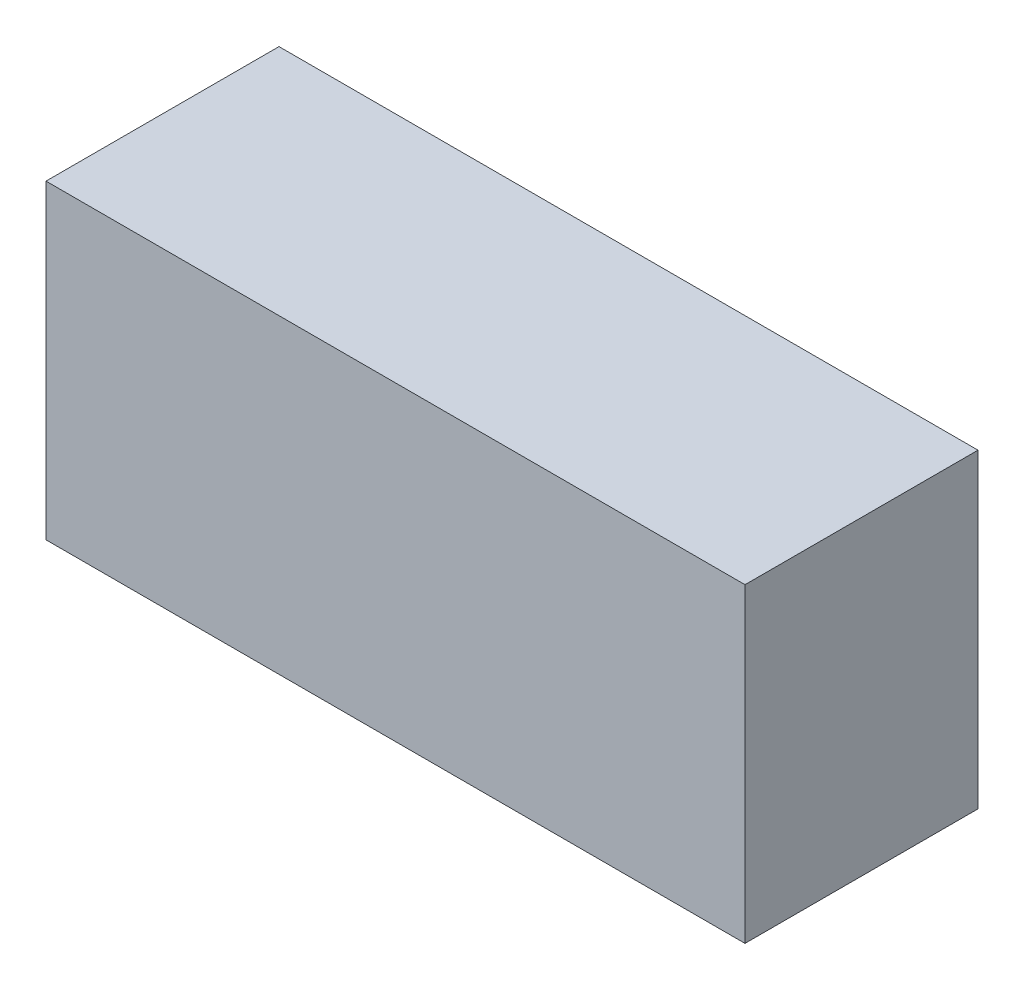
ISO-10303-21;
HEADER;
FILE_DESCRIPTION(('STEP AP214'),'2;1');
FILE_NAME('part.step','',(''),(''),'','','');
FILE_SCHEMA(('AUTOMOTIVE_DESIGN { 1 0 10303 214 1 1 1 1 }'));
ENDSEC;
DATA;
#1=APPLICATION_CONTEXT('core data for automotive mechanical design processes');
#2=APPLICATION_PROTOCOL_DEFINITION('international standard','automotive_design',2000,#1);
#3=PRODUCT_CONTEXT('',#1,'mechanical');
#4=PRODUCT('Part','Part','',(#3));
#5=PRODUCT_RELATED_PRODUCT_CATEGORY('part','',(#4));
#6=PRODUCT_DEFINITION_FORMATION('','',#4);
#7=PRODUCT_DEFINITION_CONTEXT('part definition',#1,'design');
#8=PRODUCT_DEFINITION('design','',#6,#7);
#9=PRODUCT_DEFINITION_SHAPE('','',#8);
#10=(LENGTH_UNIT() NAMED_UNIT(*) SI_UNIT(.MILLI.,.METRE.));
#11=(NAMED_UNIT(*) PLANE_ANGLE_UNIT() SI_UNIT($,.RADIAN.));
#12=(NAMED_UNIT(*) SI_UNIT($,.STERADIAN.) SOLID_ANGLE_UNIT());
#13=UNCERTAINTY_MEASURE_WITH_UNIT(LENGTH_MEASURE(1.E-05),#10,'distance_accuracy_value','');
#14=(GEOMETRIC_REPRESENTATION_CONTEXT(3) GLOBAL_UNCERTAINTY_ASSIGNED_CONTEXT((#13)) GLOBAL_UNIT_ASSIGNED_CONTEXT((#10,
#11,#12)) REPRESENTATION_CONTEXT('',''));
#15=CARTESIAN_POINT('',(0.,0.,0.));
#16=DIRECTION('',(0.,0.,1.));
#17=DIRECTION('',(1.,0.,0.));
#18=AXIS2_PLACEMENT_3D('',#15,#16,#17);
#19=CARTESIAN_POINT('',(-60.8405481941615,-21.5548398331563,3.));
#20=DIRECTION('',(1.,0.,0.));
#21=DIRECTION('',(0.,0.,-1.));
#22=AXIS2_PLACEMENT_3D('',#19,#20,#21);
#23=PLANE('',#22);
#24=DIRECTION('',(0.,-1.,0.));
#25=VECTOR('',#24,1.);
#26=CARTESIAN_POINT('',(-60.8405481941615,-21.5548398331563,0.));
#27=LINE('',#26,#25);
#28=CARTESIAN_POINT('',(-60.8405481941615,-17.5548398331563,0.));
#29=VERTEX_POINT('',#28);
#30=CARTESIAN_POINT('',(-60.8405481941615,-21.5548398331563,0.));
#31=VERTEX_POINT('',#30);
#32=EDGE_CURVE('E96',#29,#31,#27,.T.);
#33=ORIENTED_EDGE('',*,*,#32,.T.);
#34=DIRECTION('',(0.,0.,-1.));
#35=VECTOR('',#34,1.);
#36=CARTESIAN_POINT('',(-60.8405481941615,-21.5548398331563,3.));
#37=LINE('',#36,#35);
#38=CARTESIAN_POINT('',(-60.8405481941615,-21.5548398331563,3.));
#39=VERTEX_POINT('',#38);
#40=EDGE_CURVE('E11',#39,#31,#37,.T.);
#41=ORIENTED_EDGE('',*,*,#40,.F.);
#42=DIRECTION('',(0.,-1.,0.));
#43=VECTOR('',#42,1.);
#44=CARTESIAN_POINT('',(-60.8405481941615,-21.5548398331563,3.));
#45=LINE('',#44,#43);
#46=CARTESIAN_POINT('',(-60.8405481941615,-17.5548398331563,3.));
#47=VERTEX_POINT('',#46);
#48=EDGE_CURVE('E84',#47,#39,#45,.T.);
#49=ORIENTED_EDGE('',*,*,#48,.F.);
#50=DIRECTION('',(0.,0.,-1.));
#51=VECTOR('',#50,1.);
#52=CARTESIAN_POINT('',(-60.8405481941615,-17.5548398331563,3.));
#53=LINE('',#52,#51);
#54=EDGE_CURVE('E92',#47,#29,#53,.T.);
#55=ORIENTED_EDGE('',*,*,#54,.T.);
#56=EDGE_LOOP('',(#33,#41,#49,#55));
#57=FACE_BOUND('',#56,.T.);
#58=ADVANCED_FACE('F33',(#57),#23,.F.);
#59=CARTESIAN_POINT('',(-60.8405481941615,-21.5548398331563,3.));
#60=DIRECTION('',(0.,1.,0.));
#61=DIRECTION('',(0.,0.,1.));
#62=AXIS2_PLACEMENT_3D('',#59,#60,#61);
#63=PLANE('',#62);
#64=DIRECTION('',(1.,0.,0.));
#65=VECTOR('',#64,1.);
#66=CARTESIAN_POINT('',(-60.8405481941615,-21.5548398331563,0.));
#67=LINE('',#66,#65);
#68=CARTESIAN_POINT('',(-51.8405481941615,-21.5548398331563,0.));
#69=VERTEX_POINT('',#68);
#70=EDGE_CURVE('E88',#31,#69,#67,.T.);
#71=ORIENTED_EDGE('',*,*,#70,.T.);
#72=DIRECTION('',(0.,0.,-1.));
#73=VECTOR('',#72,1.);
#74=CARTESIAN_POINT('',(-51.8405481941615,-21.5548398331563,3.));
#75=LINE('',#74,#73);
#76=CARTESIAN_POINT('',(-51.8405481941615,-21.5548398331563,3.));
#77=VERTEX_POINT('',#76);
#78=EDGE_CURVE('E41',#77,#69,#75,.T.);
#79=ORIENTED_EDGE('',*,*,#78,.F.);
#80=DIRECTION('',(1.,0.,0.));
#81=VECTOR('',#80,1.);
#82=CARTESIAN_POINT('',(-60.8405481941615,-21.5548398331563,3.));
#83=LINE('',#82,#81);
#84=EDGE_CURVE('E79',#39,#77,#83,.T.);
#85=ORIENTED_EDGE('',*,*,#84,.F.);
#86=ORIENTED_EDGE('',*,*,#40,.T.);
#87=EDGE_LOOP('',(#71,#79,#85,#86));
#88=FACE_BOUND('',#87,.T.);
#89=ADVANCED_FACE('F87',(#88),#63,.F.);
#90=CARTESIAN_POINT('',(-51.8405481941615,-21.5548398331563,3.));
#91=DIRECTION('',(-1.,0.,0.));
#92=DIRECTION('',(0.,0.,1.));
#93=AXIS2_PLACEMENT_3D('',#90,#91,#92);
#94=PLANE('',#93);
#95=DIRECTION('',(0.,1.,0.));
#96=VECTOR('',#95,1.);
#97=CARTESIAN_POINT('',(-51.8405481941615,-21.5548398331563,0.));
#98=LINE('',#97,#96);
#99=CARTESIAN_POINT('',(-51.8405481941615,-17.5548398331563,0.));
#100=VERTEX_POINT('',#99);
#101=EDGE_CURVE('E66',#69,#100,#98,.T.);
#102=ORIENTED_EDGE('',*,*,#101,.T.);
#103=DIRECTION('',(0.,0.,-1.));
#104=VECTOR('',#103,1.);
#105=CARTESIAN_POINT('',(-51.8405481941615,-17.5548398331563,3.));
#106=LINE('',#105,#104);
#107=CARTESIAN_POINT('',(-51.8405481941615,-17.5548398331563,3.));
#108=VERTEX_POINT('',#107);
#109=EDGE_CURVE('E89',#108,#100,#106,.T.);
#110=ORIENTED_EDGE('',*,*,#109,.F.);
#111=DIRECTION('',(0.,1.,0.));
#112=VECTOR('',#111,1.);
#113=CARTESIAN_POINT('',(-51.8405481941615,-21.5548398331563,3.));
#114=LINE('',#113,#112);
#115=EDGE_CURVE('E82',#77,#108,#114,.T.);
#116=ORIENTED_EDGE('',*,*,#115,.F.);
#117=ORIENTED_EDGE('',*,*,#78,.T.);
#118=EDGE_LOOP('',(#102,#110,#116,#117));
#119=FACE_BOUND('',#118,.T.);
#120=ADVANCED_FACE('F90',(#119),#94,.F.);
#121=CARTESIAN_POINT('',(-60.8405481941615,-17.5548398331563,3.));
#122=DIRECTION('',(0.,-1.,0.));
#123=DIRECTION('',(0.,0.,-1.));
#124=AXIS2_PLACEMENT_3D('',#121,#122,#123);
#125=PLANE('',#124);
#126=DIRECTION('',(-1.,0.,0.));
#127=VECTOR('',#126,1.);
#128=CARTESIAN_POINT('',(-60.8405481941615,-17.5548398331563,0.));
#129=LINE('',#128,#127);
#130=EDGE_CURVE('E72',#100,#29,#129,.T.);
#131=ORIENTED_EDGE('',*,*,#130,.T.);
#132=ORIENTED_EDGE('',*,*,#54,.F.);
#133=DIRECTION('',(-1.,0.,0.));
#134=VECTOR('',#133,1.);
#135=CARTESIAN_POINT('',(-60.8405481941615,-17.5548398331563,3.));
#136=LINE('',#135,#134);
#137=EDGE_CURVE('E49',#108,#47,#136,.T.);
#138=ORIENTED_EDGE('',*,*,#137,.F.);
#139=ORIENTED_EDGE('',*,*,#109,.T.);
#140=EDGE_LOOP('',(#131,#132,#138,#139));
#141=FACE_BOUND('',#140,.T.);
#142=ADVANCED_FACE('F103',(#141),#125,.F.);
#143=CARTESIAN_POINT('',(0.,0.,3.));
#144=DIRECTION('',(0.,0.,-1.));
#145=DIRECTION('',(-1.,0.,0.));
#146=AXIS2_PLACEMENT_3D('',#143,#144,#145);
#147=PLANE('',#146);
#148=ORIENTED_EDGE('',*,*,#48,.T.);
#149=ORIENTED_EDGE('',*,*,#84,.T.);
#150=ORIENTED_EDGE('',*,*,#115,.T.);
#151=ORIENTED_EDGE('',*,*,#137,.T.);
#152=EDGE_LOOP('',(#148,#149,#150,#151));
#153=FACE_BOUND('',#152,.T.);
#154=ADVANCED_FACE('F80',(#153),#147,.F.);
#155=CARTESIAN_POINT('',(0.,0.,0.));
#156=DIRECTION('',(0.,0.,-1.));
#157=DIRECTION('',(-1.,0.,0.));
#158=AXIS2_PLACEMENT_3D('',#155,#156,#157);
#159=PLANE('',#158);
#160=ORIENTED_EDGE('',*,*,#32,.F.);
#161=ORIENTED_EDGE('',*,*,#130,.F.);
#162=ORIENTED_EDGE('',*,*,#101,.F.);
#163=ORIENTED_EDGE('',*,*,#70,.F.);
#164=EDGE_LOOP('',(#160,#161,#162,#163));
#165=FACE_BOUND('',#164,.T.);
#166=ADVANCED_FACE('F106',(#165),#159,.T.);
#167=CLOSED_SHELL('',(#58,#89,#120,#142,#154,#166));
#168=MANIFOLD_SOLID_BREP('B2',#167);
#169=ADVANCED_BREP_SHAPE_REPRESENTATION('',(#18,#168),#14);
#170=SHAPE_DEFINITION_REPRESENTATION(#9,#169);
ENDSEC;
END-ISO-10303-21;
